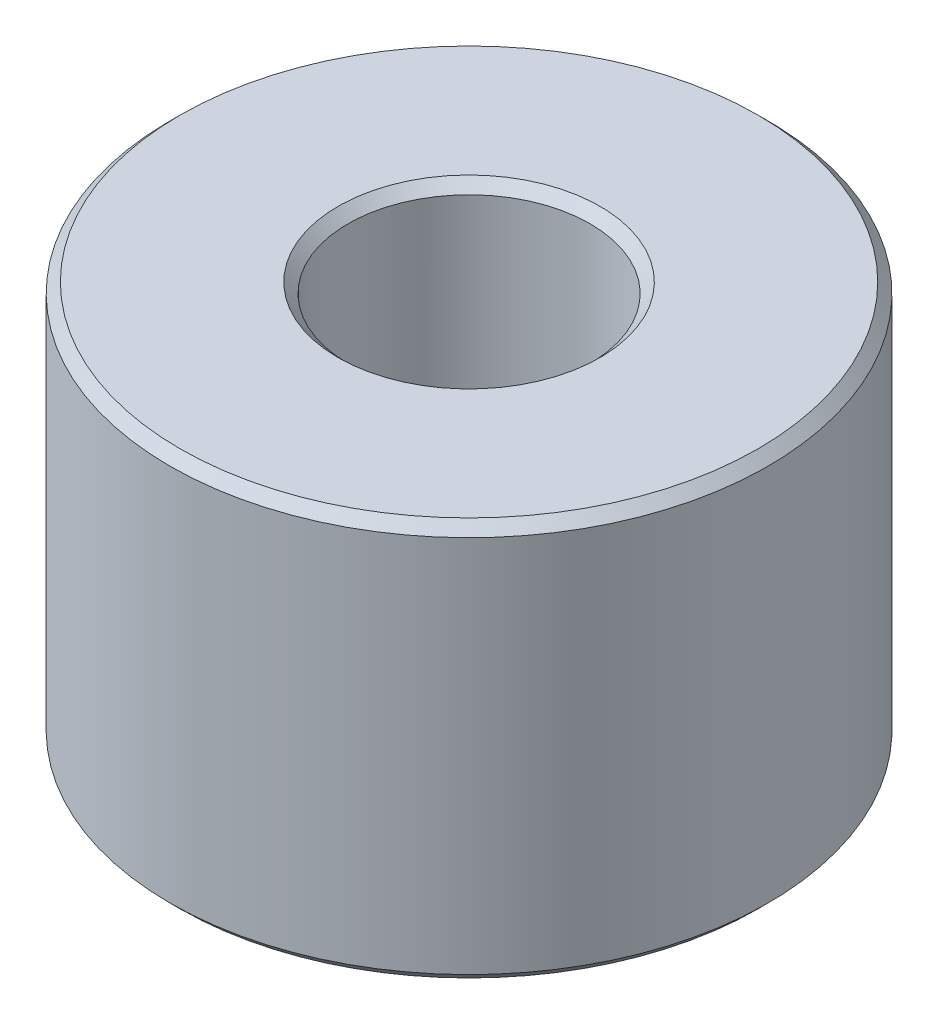
ISO-10303-21;
HEADER;
FILE_DESCRIPTION(('STEP AP214'),'2;1');
FILE_NAME('part.step','',(''),(''),'','','');
FILE_SCHEMA(('AUTOMOTIVE_DESIGN { 1 0 10303 214 1 1 1 1 }'));
ENDSEC;
DATA;
#1=APPLICATION_CONTEXT('core data for automotive mechanical design processes');
#2=APPLICATION_PROTOCOL_DEFINITION('international standard','automotive_design',2000,#1);
#3=PRODUCT_CONTEXT('',#1,'mechanical');
#4=PRODUCT('Part','Part','',(#3));
#5=PRODUCT_RELATED_PRODUCT_CATEGORY('part','',(#4));
#6=PRODUCT_DEFINITION_FORMATION('','',#4);
#7=PRODUCT_DEFINITION_CONTEXT('part definition',#1,'design');
#8=PRODUCT_DEFINITION('design','',#6,#7);
#9=PRODUCT_DEFINITION_SHAPE('','',#8);
#10=(LENGTH_UNIT() NAMED_UNIT(*) SI_UNIT(.MILLI.,.METRE.));
#11=(NAMED_UNIT(*) PLANE_ANGLE_UNIT() SI_UNIT($,.RADIAN.));
#12=(NAMED_UNIT(*) SI_UNIT($,.STERADIAN.) SOLID_ANGLE_UNIT());
#13=UNCERTAINTY_MEASURE_WITH_UNIT(LENGTH_MEASURE(1.E-05),#10,'distance_accuracy_value','');
#14=(GEOMETRIC_REPRESENTATION_CONTEXT(3) GLOBAL_UNCERTAINTY_ASSIGNED_CONTEXT((#13)) GLOBAL_UNIT_ASSIGNED_CONTEXT((#10,
#11,#12)) REPRESENTATION_CONTEXT('',''));
#15=CARTESIAN_POINT('',(0.,0.,0.));
#16=DIRECTION('',(0.,0.,1.));
#17=DIRECTION('',(1.,0.,0.));
#18=AXIS2_PLACEMENT_3D('',#15,#16,#17);
#19=CARTESIAN_POINT('',(0.,39.9718992895824,0.));
#20=DIRECTION('',(0.,-1.,0.));
#21=DIRECTION('',(0.,0.,-1.));
#22=AXIS2_PLACEMENT_3D('',#19,#20,#21);
#23=CYLINDRICAL_SURFACE('',#22,30.);
#24=CARTESIAN_POINT('',(0.,1.0062741809756,0.));
#25=DIRECTION('',(0.,1.,0.));
#26=DIRECTION('',(0.,0.,1.));
#27=AXIS2_PLACEMENT_3D('',#24,#25,#26);
#28=CIRCLE('',#27,30.);
#29=CARTESIAN_POINT('',(0.,1.0062741809756,30.));
#30=VERTEX_POINT('',#29);
#31=EDGE_CURVE('E10',#30,#30,#28,.T.);
#32=ORIENTED_EDGE('',*,*,#31,.T.);
#33=EDGE_LOOP('',(#32));
#34=FACE_BOUND('',#33,.T.);
#35=CARTESIAN_POINT('',(0.,38.9656251086068,0.));
#36=DIRECTION('',(0.,1.,0.));
#37=DIRECTION('',(0.,0.,1.));
#38=AXIS2_PLACEMENT_3D('',#35,#36,#37);
#39=CIRCLE('',#38,30.);
#40=CARTESIAN_POINT('',(0.,38.9656251086068,30.));
#41=VERTEX_POINT('',#40);
#42=EDGE_CURVE('E50',#41,#41,#39,.F.);
#43=ORIENTED_EDGE('',*,*,#42,.T.);
#44=EDGE_LOOP('',(#43));
#45=FACE_BOUND('',#44,.T.);
#46=ADVANCED_FACE('F39',(#34,#45),#23,.T.);
#47=CARTESIAN_POINT('',(0.,39.9718992895824,0.));
#48=DIRECTION('',(0.,1.,0.));
#49=DIRECTION('',(0.,0.,1.));
#50=AXIS2_PLACEMENT_3D('',#47,#48,#49);
#51=PLANE('',#50);
#52=CARTESIAN_POINT('',(0.,39.9718992895824,0.));
#53=DIRECTION('',(0.,1.,0.));
#54=DIRECTION('',(0.,0.,1.));
#55=AXIS2_PLACEMENT_3D('',#52,#53,#54);
#56=CIRCLE('',#55,13.1456208814467);
#57=CARTESIAN_POINT('',(0.,39.9718992895824,13.1456208814467));
#58=VERTEX_POINT('',#57);
#59=EDGE_CURVE('E58',#58,#58,#56,.F.);
#60=ORIENTED_EDGE('',*,*,#59,.T.);
#61=EDGE_LOOP('',(#60));
#62=FACE_BOUND('',#61,.T.);
#63=CARTESIAN_POINT('',(0.,39.9718992895824,0.));
#64=DIRECTION('',(0.,1.,0.));
#65=DIRECTION('',(0.,0.,1.));
#66=AXIS2_PLACEMENT_3D('',#63,#64,#65);
#67=CIRCLE('',#66,28.9937258190244);
#68=CARTESIAN_POINT('',(0.,39.9718992895824,28.9937258190244));
#69=VERTEX_POINT('',#68);
#70=EDGE_CURVE('E61',#69,#69,#67,.T.);
#71=ORIENTED_EDGE('',*,*,#70,.T.);
#72=EDGE_LOOP('',(#71));
#73=FACE_BOUND('',#72,.T.);
#74=ADVANCED_FACE('F88',(#62,#73),#51,.T.);
#75=CARTESIAN_POINT('',(0.,0.,0.));
#76=DIRECTION('',(0.,1.,0.));
#77=DIRECTION('',(0.,0.,1.));
#78=AXIS2_PLACEMENT_3D('',#75,#76,#77);
#79=PLANE('',#78);
#80=CARTESIAN_POINT('',(0.,0.,0.));
#81=DIRECTION('',(0.,1.,0.));
#82=DIRECTION('',(0.,0.,1.));
#83=AXIS2_PLACEMENT_3D('',#80,#81,#82);
#84=CIRCLE('',#83,13.1456208814467);
#85=CARTESIAN_POINT('',(0.,0.,-13.1456208814467));
#86=VERTEX_POINT('',#85);
#87=EDGE_CURVE('E51',#86,#86,#84,.T.);
#88=ORIENTED_EDGE('',*,*,#87,.T.);
#89=EDGE_LOOP('',(#88));
#90=FACE_BOUND('',#89,.T.);
#91=CARTESIAN_POINT('',(0.,0.,0.));
#92=DIRECTION('',(0.,1.,0.));
#93=DIRECTION('',(0.,0.,1.));
#94=AXIS2_PLACEMENT_3D('',#91,#92,#93);
#95=CIRCLE('',#94,28.9937258190244);
#96=CARTESIAN_POINT('',(0.,0.,28.9937258190244));
#97=VERTEX_POINT('',#96);
#98=EDGE_CURVE('E54',#97,#97,#95,.F.);
#99=ORIENTED_EDGE('',*,*,#98,.T.);
#100=EDGE_LOOP('',(#99));
#101=FACE_BOUND('',#100,.T.);
#102=ADVANCED_FACE('F83',(#90,#101),#79,.F.);
#103=CARTESIAN_POINT('',(0.,39.9718992895824,0.));
#104=DIRECTION('',(0.,-1.,0.));
#105=DIRECTION('',(0.,0.,-1.));
#106=AXIS2_PLACEMENT_3D('',#103,#104,#105);
#107=CYLINDRICAL_SURFACE('',#106,12.1393467004711);
#108=CARTESIAN_POINT('',(0.,38.9656251086069,0.));
#109=DIRECTION('',(0.,1.,0.));
#110=DIRECTION('',(0.,0.,1.));
#111=AXIS2_PLACEMENT_3D('',#108,#109,#110);
#112=CIRCLE('',#111,12.1393467004711);
#113=CARTESIAN_POINT('',(0.,38.9656251086069,12.1393467004711));
#114=VERTEX_POINT('',#113);
#115=EDGE_CURVE('E67',#114,#114,#112,.T.);
#116=ORIENTED_EDGE('',*,*,#115,.T.);
#117=EDGE_LOOP('',(#116));
#118=FACE_BOUND('',#117,.T.);
#119=CARTESIAN_POINT('',(0.,1.00627418097562,0.));
#120=DIRECTION('',(0.,1.,0.));
#121=DIRECTION('',(0.,0.,1.));
#122=AXIS2_PLACEMENT_3D('',#119,#120,#121);
#123=CIRCLE('',#122,12.1393467004711);
#124=CARTESIAN_POINT('',(0.,1.00627418097562,-12.1393467004711));
#125=VERTEX_POINT('',#124);
#126=EDGE_CURVE('E69',#125,#125,#123,.F.);
#127=ORIENTED_EDGE('',*,*,#126,.T.);
#128=EDGE_LOOP('',(#127));
#129=FACE_BOUND('',#128,.T.);
#130=ADVANCED_FACE('F71',(#118,#129),#107,.F.);
#131=CARTESIAN_POINT('',(0.,38.9656251086069,0.));
#132=DIRECTION('',(0.,1.,0.));
#133=DIRECTION('',(0.,0.,1.));
#134=AXIS2_PLACEMENT_3D('',#131,#132,#133);
#135=CONICAL_SURFACE('',#134,12.1393467004711,0.785398163397462);
#136=ORIENTED_EDGE('',*,*,#59,.F.);
#137=EDGE_LOOP('',(#136));
#138=FACE_BOUND('',#137,.T.);
#139=ORIENTED_EDGE('',*,*,#115,.F.);
#140=EDGE_LOOP('',(#139));
#141=FACE_BOUND('',#140,.T.);
#142=ADVANCED_FACE('F77',(#138,#141),#135,.F.);
#143=CARTESIAN_POINT('',(0.,0.,0.));
#144=DIRECTION('',(0.,-1.,0.));
#145=DIRECTION('',(0.,0.,-1.));
#146=AXIS2_PLACEMENT_3D('',#143,#144,#145);
#147=CONICAL_SURFACE('',#146,13.1456208814467,0.785398163397448);
#148=CARTESIAN_POINT('',(0.,1.00627418097562,-12.1393467004711));
#149=CARTESIAN_POINT('',(0.,0.995792158257121,-12.1498287231896));
#150=CARTESIAN_POINT('',(0.,0.985310135538625,-12.160310745908));
#151=CARTESIAN_POINT('',(0.,0.964346090101634,-12.181274791345));
#152=CARTESIAN_POINT('',(0.,0.953864067383138,-12.1917568140635));
#153=CARTESIAN_POINT('',(0.,0.932900021946146,-12.2127208595005));
#154=CARTESIAN_POINT('',(0.,0.922417999227649,-12.223202882219));
#155=CARTESIAN_POINT('',(0.,0.901453953790657,-12.244166927656));
#156=CARTESIAN_POINT('',(0.,0.890971931072162,-12.2546489503745));
#157=CARTESIAN_POINT('',(0.,0.87000788563517,-12.2756129958115));
#158=CARTESIAN_POINT('',(0.,0.859525862916674,-12.28609501853));
#159=CARTESIAN_POINT('',(0.,0.838561817479681,-12.307059063967));
#160=CARTESIAN_POINT('',(0.,0.828079794761185,-12.3175410866855));
#161=CARTESIAN_POINT('',(0.,0.807115749324193,-12.3385051321225));
#162=CARTESIAN_POINT('',(0.,0.796633726605698,-12.348987154841));
#163=CARTESIAN_POINT('',(0.,0.775669681168705,-12.369951200278));
#164=CARTESIAN_POINT('',(0.,0.765187658450209,-12.3804332229965));
#165=CARTESIAN_POINT('',(0.,0.744223613013217,-12.4013972684335));
#166=CARTESIAN_POINT('',(0.,0.733741590294721,-12.411879291152));
#167=CARTESIAN_POINT('',(0.,0.712777544857729,-12.4328433365889));
#168=CARTESIAN_POINT('',(0.,0.702295522139233,-12.4433253593074));
#169=CARTESIAN_POINT('',(0.,0.681331476702241,-12.4642894047444));
#170=CARTESIAN_POINT('',(0.,0.670849453983745,-12.4747714274629));
#171=CARTESIAN_POINT('',(0.,0.649885408546753,-12.4957354728999));
#172=CARTESIAN_POINT('',(0.,0.639403385828257,-12.5062174956184));
#173=CARTESIAN_POINT('',(0.,0.618439340391265,-12.5271815410554));
#174=CARTESIAN_POINT('',(0.,0.607957317672769,-12.5376635637739));
#175=CARTESIAN_POINT('',(0.,0.586993272235777,-12.5586276092109));
#176=CARTESIAN_POINT('',(0.,0.576511249517281,-12.5691096319294));
#177=CARTESIAN_POINT('',(0.,0.555547204080289,-12.5900736773664));
#178=CARTESIAN_POINT('',(0.,0.545065181361793,-12.6005557000849));
#179=CARTESIAN_POINT('',(0.,0.524101135924801,-12.6215197455219));
#180=CARTESIAN_POINT('',(0.,0.513619113206305,-12.6320017682404));
#181=CARTESIAN_POINT('',(0.,0.492655067769313,-12.6529658136774));
#182=CARTESIAN_POINT('',(0.,0.482173045050817,-12.6634478363959));
#183=CARTESIAN_POINT('',(0.,0.461208999613825,-12.6844118818329));
#184=CARTESIAN_POINT('',(0.,0.450726976895329,-12.6948939045513));
#185=CARTESIAN_POINT('',(0.,0.429762931458337,-12.7158579499883));
#186=CARTESIAN_POINT('',(0.,0.419280908739841,-12.7263399727068));
#187=CARTESIAN_POINT('',(0.,0.398316863302849,-12.7473040181438));
#188=CARTESIAN_POINT('',(0.,0.387834840584353,-12.7577860408623));
#189=CARTESIAN_POINT('',(0.,0.366870795147361,-12.7787500862993));
#190=CARTESIAN_POINT('',(0.,0.356388772428865,-12.7892321090178));
#191=CARTESIAN_POINT('',(0.,0.335424726991872,-12.8101961544548));
#192=CARTESIAN_POINT('',(0.,0.324942704273376,-12.8206781771733));
#193=CARTESIAN_POINT('',(0.,0.303978658836384,-12.8416422226103));
#194=CARTESIAN_POINT('',(0.,0.293496636117889,-12.8521242453288));
#195=CARTESIAN_POINT('',(0.,0.272532590680897,-12.8730882907658));
#196=CARTESIAN_POINT('',(0.,0.262050567962401,-12.8835703134843));
#197=CARTESIAN_POINT('',(0.,0.241086522525408,-12.9045343589213));
#198=CARTESIAN_POINT('',(0.,0.230604499806912,-12.9150163816398));
#199=CARTESIAN_POINT('',(0.,0.20964045436992,-12.9359804270768));
#200=CARTESIAN_POINT('',(0.,0.199158431651424,-12.9464624497953));
#201=CARTESIAN_POINT('',(0.,0.178194386214433,-12.9674264952322));
#202=CARTESIAN_POINT('',(0.,0.167712363495936,-12.9779085179507));
#203=CARTESIAN_POINT('',(0.,0.146748318058944,-12.9988725633877));
#204=CARTESIAN_POINT('',(0.,0.136266295340448,-13.0093545861062));
#205=CARTESIAN_POINT('',(0.,0.115302249903456,-13.0303186315432));
#206=CARTESIAN_POINT('',(0.,0.10482022718496,-13.0408006542617));
#207=CARTESIAN_POINT('',(0.,0.0838561817479683,-13.0617646996987));
#208=CARTESIAN_POINT('',(0.,0.073374159029472,-13.0722467224172));
#209=CARTESIAN_POINT('',(0.,0.0524101135924799,-13.0932107678542));
#210=CARTESIAN_POINT('',(0.,0.0419280908739841,-13.1036927905727));
#211=CARTESIAN_POINT('',(0.,0.0209640454369923,-13.1246568360097));
#212=CARTESIAN_POINT('',(0.,0.0104820227184965,-13.1351388587282));
#213=CARTESIAN_POINT('',(0.,0.,-13.1456208814467));
#214=B_SPLINE_CURVE_WITH_KNOTS('',3,(#148,#149,#150,#151,#152,#153,#154,#155,#156,#157,#158,
#159,#160,#161,#162,#163,#164,#165,#166,#167,#168,#169,#170,#171,#172,#173,#174,#175,#176,#177,
#178,#179,#180,#181,#182,#183,#184,#185,#186,#187,#188,#189,#190,#191,#192,#193,#194,#195,#196,
#197,#198,#199,#200,#201,#202,#203,#204,#205,#206,#207,#208,#209,#210,#211,#212,#213),
.UNSPECIFIED.,.F.,.F.,(4,2,2,2,2,2,2,2,2,2,2,2,2,2,2,2,2,2,2,2,2,2,2,2,2,2,2,2,2,2,2,2,4),(0.,
0.0444714560687994,0.0889429121376001,0.1334143682064,0.1778858242752,0.222357280344,
0.266828736412799,0.3113001924816,0.355771648550399,0.400243104619199,0.444714560687999,
0.489186016756799,0.533657472825598,0.578128928894399,0.622600384963198,0.667071841031999,
0.711543297100798,0.756014753169598,0.800486209238399,0.844957665307198,0.889429121375999,
0.933900577444798,0.978372033513597,1.0228434895824,1.0673149456512,1.11178640172,
1.1562578577888,1.2007293138576,1.2452007699264,1.2896722259952,1.334143682064,1.3786151381328,
1.4230865942016),.UNSPECIFIED.);
#215=EDGE_CURVE('BSEAM73',#125,#86,#214,.T.);
#216=ORIENTED_EDGE('',*,*,#126,.F.);
#217=ORIENTED_EDGE('',*,*,#87,.F.);
#218=ORIENTED_EDGE('',*,*,#215,.T.);
#219=ORIENTED_EDGE('',*,*,#215,.F.);
#220=EDGE_LOOP('',(#216,#218,#217,#219));
#221=FACE_BOUND('',#220,.T.);
#222=ADVANCED_FACE('F73',(#221),#147,.F.);
#223=CARTESIAN_POINT('',(0.,1.0062741809756,0.));
#224=DIRECTION('',(0.,1.,0.));
#225=DIRECTION('',(0.,0.,1.));
#226=AXIS2_PLACEMENT_3D('',#223,#224,#225);
#227=CONICAL_SURFACE('',#226,30.,0.785398163397452);
#228=ORIENTED_EDGE('',*,*,#98,.F.);
#229=EDGE_LOOP('',(#228));
#230=FACE_BOUND('',#229,.T.);
#231=ORIENTED_EDGE('',*,*,#31,.F.);
#232=EDGE_LOOP('',(#231));
#233=FACE_BOUND('',#232,.T.);
#234=ADVANCED_FACE('F76',(#230,#233),#227,.T.);
#235=CARTESIAN_POINT('',(0.,39.9718992895824,0.));
#236=DIRECTION('',(0.,-1.,0.));
#237=DIRECTION('',(0.,0.,-1.));
#238=AXIS2_PLACEMENT_3D('',#235,#236,#237);
#239=CONICAL_SURFACE('',#238,28.9937258190244,0.785398163397452);
#240=ORIENTED_EDGE('',*,*,#42,.F.);
#241=EDGE_LOOP('',(#240));
#242=FACE_BOUND('',#241,.T.);
#243=ORIENTED_EDGE('',*,*,#70,.F.);
#244=EDGE_LOOP('',(#243));
#245=FACE_BOUND('',#244,.T.);
#246=ADVANCED_FACE('F45',(#242,#245),#239,.T.);
#247=CLOSED_SHELL('',(#46,#74,#102,#130,#142,#222,#234,#246));
#248=MANIFOLD_SOLID_BREP('B2',#247);
#249=ADVANCED_BREP_SHAPE_REPRESENTATION('',(#18,#248),#14);
#250=SHAPE_DEFINITION_REPRESENTATION(#9,#249);
ENDSEC;
END-ISO-10303-21;
